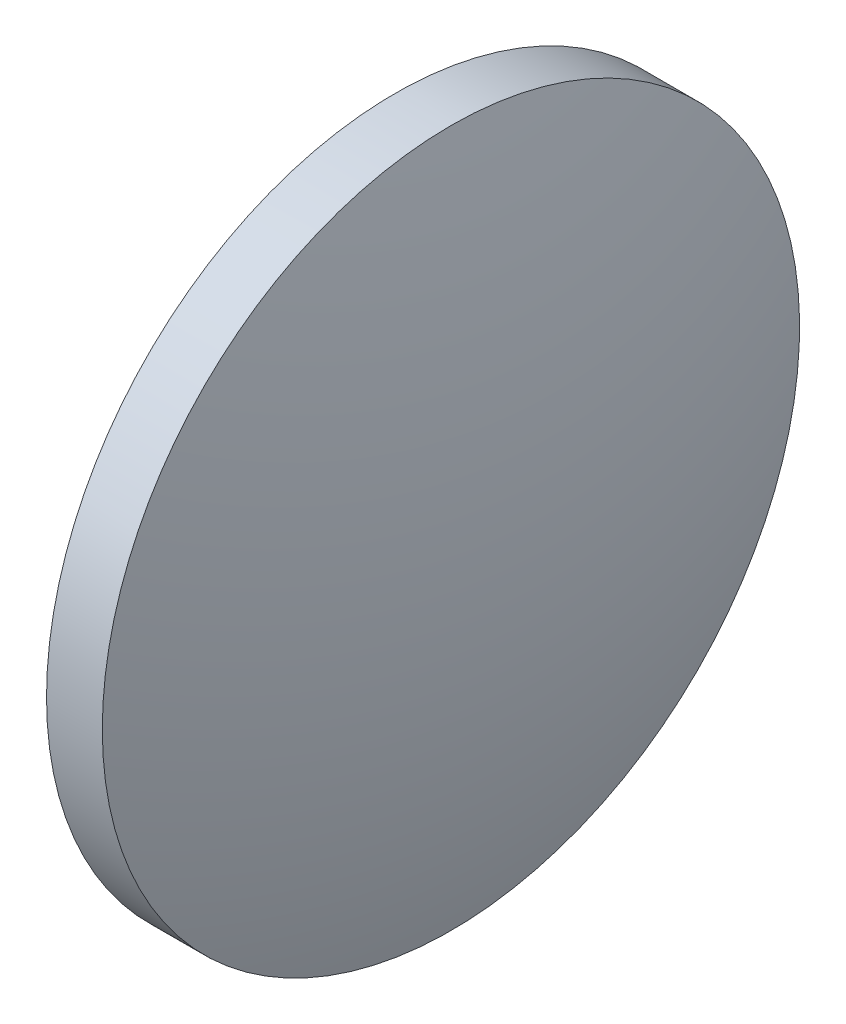
ISO-10303-21;
HEADER;
FILE_DESCRIPTION(('STEP AP214'),'2;1');
FILE_NAME('part.step','',(''),(''),'','','');
FILE_SCHEMA(('AUTOMOTIVE_DESIGN { 1 0 10303 214 1 1 1 1 }'));
ENDSEC;
DATA;
#1=APPLICATION_CONTEXT('core data for automotive mechanical design processes');
#2=APPLICATION_PROTOCOL_DEFINITION('international standard','automotive_design',2000,#1);
#3=PRODUCT_CONTEXT('',#1,'mechanical');
#4=PRODUCT('Part','Part','',(#3));
#5=PRODUCT_RELATED_PRODUCT_CATEGORY('part','',(#4));
#6=PRODUCT_DEFINITION_FORMATION('','',#4);
#7=PRODUCT_DEFINITION_CONTEXT('part definition',#1,'design');
#8=PRODUCT_DEFINITION('design','',#6,#7);
#9=PRODUCT_DEFINITION_SHAPE('','',#8);
#10=(LENGTH_UNIT() NAMED_UNIT(*) SI_UNIT(.MILLI.,.METRE.));
#11=(NAMED_UNIT(*) PLANE_ANGLE_UNIT() SI_UNIT($,.RADIAN.));
#12=(NAMED_UNIT(*) SI_UNIT($,.STERADIAN.) SOLID_ANGLE_UNIT());
#13=UNCERTAINTY_MEASURE_WITH_UNIT(LENGTH_MEASURE(1.E-05),#10,'distance_accuracy_value','');
#14=(GEOMETRIC_REPRESENTATION_CONTEXT(3) GLOBAL_UNCERTAINTY_ASSIGNED_CONTEXT((#13)) GLOBAL_UNIT_ASSIGNED_CONTEXT((#10,
#11,#12)) REPRESENTATION_CONTEXT('',''));
#15=CARTESIAN_POINT('',(0.,0.,0.));
#16=DIRECTION('',(0.,0.,1.));
#17=DIRECTION('',(1.,0.,0.));
#18=AXIS2_PLACEMENT_3D('',#15,#16,#17);
#19=CARTESIAN_POINT('',(691.516188734491,258.855164799025,0.));
#20=DIRECTION('',(-1.,0.,0.));
#21=DIRECTION('',(0.,1.,0.));
#22=AXIS2_PLACEMENT_3D('',#19,#20,#21);
#23=SPHERICAL_SURFACE('',#22,41.2406185567012);
#24=CARTESIAN_POINT('',(730.816807291192,258.855164799026,0.));
#25=DIRECTION('',(-1.,0.,0.));
#26=DIRECTION('',(0.,0.,1.));
#27=AXIS2_PLACEMENT_3D('',#24,#25,#26);
#28=CIRCLE('',#27,12.5);
#29=CARTESIAN_POINT('',(730.816807291192,258.855164799026,12.5));
#30=VERTEX_POINT('',#29);
#31=EDGE_CURVE('E10',#30,#30,#28,.T.);
#32=ORIENTED_EDGE('',*,*,#31,.F.);
#33=EDGE_LOOP('',(#32));
#34=FACE_BOUND('',#33,.T.);
#35=ADVANCED_FACE('F35',(#34),#23,.T.);
#36=CARTESIAN_POINT('',(724.074776049302,258.855164799026,0.));
#37=DIRECTION('',(-1.,0.,0.));
#38=DIRECTION('',(0.,0.,1.));
#39=AXIS2_PLACEMENT_3D('',#36,#37,#38);
#40=CYLINDRICAL_SURFACE('',#39,12.5);
#41=CARTESIAN_POINT('',(728.816807291192,258.855164799026,0.));
#42=DIRECTION('',(-1.,0.,0.));
#43=DIRECTION('',(0.,0.,1.));
#44=AXIS2_PLACEMENT_3D('',#41,#42,#43);
#45=CIRCLE('',#44,12.5);
#46=CARTESIAN_POINT('',(728.816807291192,258.855164799026,12.5));
#47=VERTEX_POINT('',#46);
#48=EDGE_CURVE('E41',#47,#47,#45,.T.);
#49=ORIENTED_EDGE('',*,*,#48,.F.);
#50=EDGE_LOOP('',(#49));
#51=FACE_BOUND('',#50,.T.);
#52=ORIENTED_EDGE('',*,*,#31,.T.);
#53=EDGE_LOOP('',(#52));
#54=FACE_BOUND('',#53,.T.);
#55=ADVANCED_FACE('F49',(#51,#54),#40,.T.);
#56=CARTESIAN_POINT('',(728.816807291192,258.855164799026,0.));
#57=DIRECTION('',(1.,0.,0.));
#58=DIRECTION('',(0.,0.,-1.));
#59=AXIS2_PLACEMENT_3D('',#56,#57,#58);
#60=PLANE('',#59);
#61=ORIENTED_EDGE('',*,*,#48,.T.);
#62=EDGE_LOOP('',(#61));
#63=FACE_BOUND('',#62,.T.);
#64=ADVANCED_FACE('F47',(#63),#60,.F.);
#65=CLOSED_SHELL('',(#35,#55,#64));
#66=MANIFOLD_SOLID_BREP('B2',#65);
#67=ADVANCED_BREP_SHAPE_REPRESENTATION('',(#18,#66),#14);
#68=SHAPE_DEFINITION_REPRESENTATION(#9,#67);
ENDSEC;
END-ISO-10303-21;
